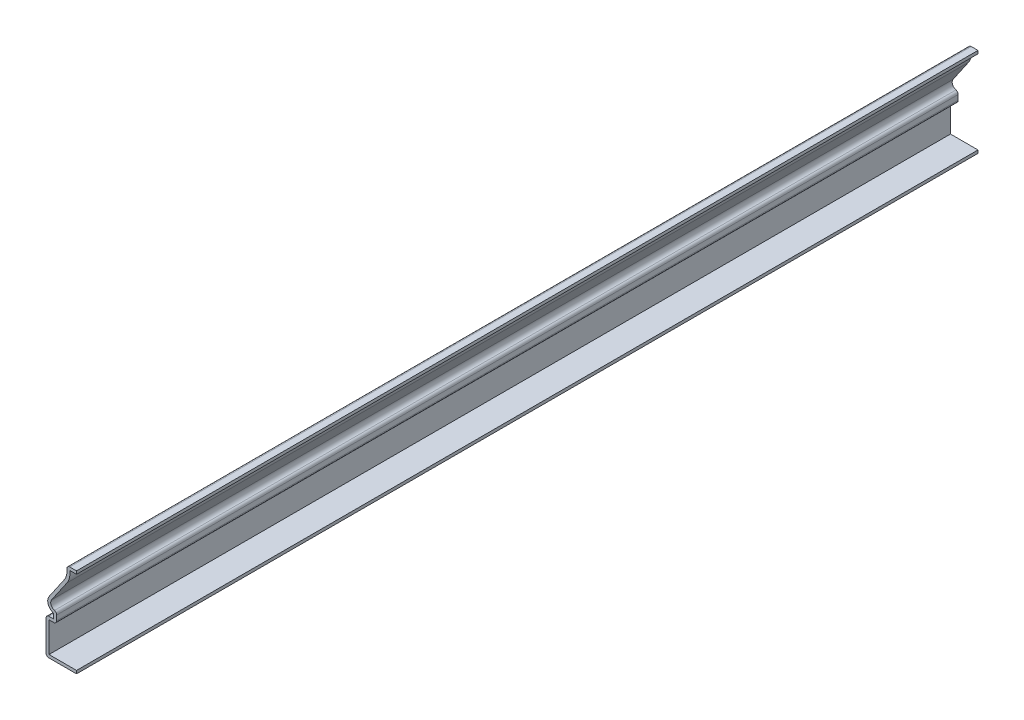
ISO-10303-21;
HEADER;
FILE_DESCRIPTION(('STEP AP214'),'2;1');
FILE_NAME('part.step','',(''),(''),'','','');
FILE_SCHEMA(('AUTOMOTIVE_DESIGN { 1 0 10303 214 1 1 1 1 }'));
ENDSEC;
DATA;
#1=APPLICATION_CONTEXT('core data for automotive mechanical design processes');
#2=APPLICATION_PROTOCOL_DEFINITION('international standard','automotive_design',2000,#1);
#3=PRODUCT_CONTEXT('',#1,'mechanical');
#4=PRODUCT('Part','Part','',(#3));
#5=PRODUCT_RELATED_PRODUCT_CATEGORY('part','',(#4));
#6=PRODUCT_DEFINITION_FORMATION('','',#4);
#7=PRODUCT_DEFINITION_CONTEXT('part definition',#1,'design');
#8=PRODUCT_DEFINITION('design','',#6,#7);
#9=PRODUCT_DEFINITION_SHAPE('','',#8);
#10=(LENGTH_UNIT() NAMED_UNIT(*) SI_UNIT(.MILLI.,.METRE.));
#11=(NAMED_UNIT(*) PLANE_ANGLE_UNIT() SI_UNIT($,.RADIAN.));
#12=(NAMED_UNIT(*) SI_UNIT($,.STERADIAN.) SOLID_ANGLE_UNIT());
#13=UNCERTAINTY_MEASURE_WITH_UNIT(LENGTH_MEASURE(1.E-05),#10,'distance_accuracy_value','');
#14=(GEOMETRIC_REPRESENTATION_CONTEXT(3) GLOBAL_UNCERTAINTY_ASSIGNED_CONTEXT((#13)) GLOBAL_UNIT_ASSIGNED_CONTEXT((#10,
#11,#12)) REPRESENTATION_CONTEXT('',''));
#15=CARTESIAN_POINT('',(0.,0.,0.));
#16=DIRECTION('',(0.,0.,1.));
#17=DIRECTION('',(1.,0.,0.));
#18=AXIS2_PLACEMENT_3D('',#15,#16,#17);
#19=CARTESIAN_POINT('',(0.,0.,-304.8));
#20=DIRECTION('',(0.,-1.,0.));
#21=DIRECTION('',(1.,0.,0.));
#22=AXIS2_PLACEMENT_3D('',#19,#20,#21);
#23=PLANE('',#22);
#24=DIRECTION('',(1.,0.,0.));
#25=VECTOR('',#24,1.);
#26=CARTESIAN_POINT('',(0.,0.,0.));
#27=LINE('',#26,#25);
#28=CARTESIAN_POINT('',(-9.30275,0.,0.));
#29=VERTEX_POINT('',#28);
#30=CARTESIAN_POINT('',(0.,0.,0.));
#31=VERTEX_POINT('',#30);
#32=EDGE_CURVE('E338',#29,#31,#27,.T.);
#33=ORIENTED_EDGE('',*,*,#32,.F.);
#34=DIRECTION('',(0.,0.,1.));
#35=VECTOR('',#34,1.);
#36=CARTESIAN_POINT('',(-9.30275,0.,-304.8));
#37=LINE('',#36,#35);
#38=CARTESIAN_POINT('',(-9.30275,0.,-304.8));
#39=VERTEX_POINT('',#38);
#40=EDGE_CURVE('E198',#29,#39,#37,.F.);
#41=ORIENTED_EDGE('',*,*,#40,.T.);
#42=DIRECTION('',(1.,0.,0.));
#43=VECTOR('',#42,1.);
#44=CARTESIAN_POINT('',(0.,0.,-304.8));
#45=LINE('',#44,#43);
#46=CARTESIAN_POINT('',(0.,0.,-304.8));
#47=VERTEX_POINT('',#46);
#48=EDGE_CURVE('E191',#39,#47,#45,.T.);
#49=ORIENTED_EDGE('',*,*,#48,.T.);
#50=DIRECTION('',(0.,0.,1.));
#51=VECTOR('',#50,1.);
#52=CARTESIAN_POINT('',(0.,0.,-304.8));
#53=LINE('',#52,#51);
#54=EDGE_CURVE('E195',#47,#31,#53,.T.);
#55=ORIENTED_EDGE('',*,*,#54,.T.);
#56=EDGE_LOOP('',(#33,#41,#49,#55));
#57=FACE_BOUND('',#56,.T.);
#58=ADVANCED_FACE('F35',(#57),#23,.T.);
#59=CARTESIAN_POINT('',(-10.31875,0.,-304.8));
#60=DIRECTION('',(-1.,0.,0.));
#61=DIRECTION('',(0.,0.,1.));
#62=AXIS2_PLACEMENT_3D('',#59,#60,#61);
#63=PLANE('',#62);
#64=DIRECTION('',(0.,-1.,0.));
#65=VECTOR('',#64,1.);
#66=CARTESIAN_POINT('',(-10.31875,0.,-304.8));
#67=LINE('',#66,#65);
#68=CARTESIAN_POINT('',(-10.31875,11.1835180216001,-304.8));
#69=VERTEX_POINT('',#68);
#70=CARTESIAN_POINT('',(-10.31875,1.016,-304.8));
#71=VERTEX_POINT('',#70);
#72=EDGE_CURVE('E215',#69,#71,#67,.T.);
#73=ORIENTED_EDGE('',*,*,#72,.T.);
#74=DIRECTION('',(0.,0.,1.));
#75=VECTOR('',#74,1.);
#76=CARTESIAN_POINT('',(-10.31875,1.016,-304.8));
#77=LINE('',#76,#75);
#78=CARTESIAN_POINT('',(-10.31875,1.016,0.));
#79=VERTEX_POINT('',#78);
#80=EDGE_CURVE('E226',#71,#79,#77,.T.);
#81=ORIENTED_EDGE('',*,*,#80,.T.);
#82=DIRECTION('',(0.,-1.,0.));
#83=VECTOR('',#82,1.);
#84=CARTESIAN_POINT('',(-10.31875,0.,0.));
#85=LINE('',#84,#83);
#86=CARTESIAN_POINT('',(-10.31875,11.1835180216001,0.));
#87=VERTEX_POINT('',#86);
#88=EDGE_CURVE('E201',#87,#79,#85,.T.);
#89=ORIENTED_EDGE('',*,*,#88,.F.);
#90=DIRECTION('',(0.,0.,1.));
#91=VECTOR('',#90,1.);
#92=CARTESIAN_POINT('',(-10.31875,11.1835180216001,-304.8));
#93=LINE('',#92,#91);
#94=EDGE_CURVE('E224',#87,#69,#93,.F.);
#95=ORIENTED_EDGE('',*,*,#94,.T.);
#96=EDGE_LOOP('',(#73,#81,#89,#95));
#97=FACE_BOUND('',#96,.T.);
#98=ADVANCED_FACE('F407',(#97),#63,.T.);
#99=CARTESIAN_POINT('',(-10.31875,12.1995180216001,-304.8));
#100=DIRECTION('',(0.,1.,0.));
#101=DIRECTION('',(0.,0.,1.));
#102=AXIS2_PLACEMENT_3D('',#99,#100,#101);
#103=PLANE('',#102);
#104=DIRECTION('',(-1.,0.,0.));
#105=VECTOR('',#104,1.);
#106=CARTESIAN_POINT('',(-10.31875,12.1995180216001,-304.8));
#107=LINE('',#106,#105);
#108=CARTESIAN_POINT('',(-7.7260001409812,12.1995180216001,-304.8));
#109=VERTEX_POINT('',#108);
#110=CARTESIAN_POINT('',(-9.30275,12.1995180216001,-304.8));
#111=VERTEX_POINT('',#110);
#112=EDGE_CURVE('E220',#109,#111,#107,.T.);
#113=ORIENTED_EDGE('',*,*,#112,.T.);
#114=DIRECTION('',(0.,0.,1.));
#115=VECTOR('',#114,1.);
#116=CARTESIAN_POINT('',(-9.30275,12.1995180216001,-304.8));
#117=LINE('',#116,#115);
#118=CARTESIAN_POINT('',(-9.30275,12.1995180216001,0.));
#119=VERTEX_POINT('',#118);
#120=EDGE_CURVE('E250',#111,#119,#117,.T.);
#121=ORIENTED_EDGE('',*,*,#120,.T.);
#122=DIRECTION('',(-1.,0.,0.));
#123=VECTOR('',#122,1.);
#124=CARTESIAN_POINT('',(-10.31875,12.1995180216001,0.));
#125=LINE('',#124,#123);
#126=CARTESIAN_POINT('',(-7.7260001409812,12.1995180216001,0.));
#127=VERTEX_POINT('',#126);
#128=EDGE_CURVE('E296',#127,#119,#125,.T.);
#129=ORIENTED_EDGE('',*,*,#128,.F.);
#130=DIRECTION('',(0.,0.,1.));
#131=VECTOR('',#130,1.);
#132=CARTESIAN_POINT('',(-7.7260001409812,12.1995180216001,-304.8));
#133=LINE('',#132,#131);
#134=EDGE_CURVE('E227',#109,#127,#133,.T.);
#135=ORIENTED_EDGE('',*,*,#134,.F.);
#136=EDGE_LOOP('',(#113,#121,#129,#135));
#137=FACE_BOUND('',#136,.T.);
#138=ADVANCED_FACE('F416',(#137),#103,.T.);
#139=CARTESIAN_POINT('',(-7.7260001409812,12.1995180216001,-304.8));
#140=DIRECTION('',(-1.,0.,0.));
#141=DIRECTION('',(0.,0.,1.));
#142=AXIS2_PLACEMENT_3D('',#139,#140,#141);
#143=PLANE('',#142);
#144=DIRECTION('',(0.,-1.,0.));
#145=VECTOR('',#144,1.);
#146=CARTESIAN_POINT('',(-7.7260001409812,12.1995180216001,0.));
#147=LINE('',#146,#145);
#148=CARTESIAN_POINT('',(-7.7260001409812,13.8788362660862,0.));
#149=VERTEX_POINT('',#148);
#150=EDGE_CURVE('E293',#149,#127,#147,.T.);
#151=ORIENTED_EDGE('',*,*,#150,.F.);
#152=DIRECTION('',(0.,0.,1.));
#153=VECTOR('',#152,1.);
#154=CARTESIAN_POINT('',(-7.7260001409812,13.8788362660862,-304.8));
#155=LINE('',#154,#153);
#156=CARTESIAN_POINT('',(-7.7260001409812,13.8788362660862,-304.8));
#157=VERTEX_POINT('',#156);
#158=EDGE_CURVE('E301',#157,#149,#155,.T.);
#159=ORIENTED_EDGE('',*,*,#158,.F.);
#160=DIRECTION('',(0.,-1.,0.));
#161=VECTOR('',#160,1.);
#162=CARTESIAN_POINT('',(-7.7260001409812,12.1995180216001,-304.8));
#163=LINE('',#162,#161);
#164=EDGE_CURVE('E397',#157,#109,#163,.T.);
#165=ORIENTED_EDGE('',*,*,#164,.T.);
#166=ORIENTED_EDGE('',*,*,#134,.T.);
#167=EDGE_LOOP('',(#151,#159,#165,#166));
#168=FACE_BOUND('',#167,.T.);
#169=ADVANCED_FACE('F420',(#168),#143,.T.);
#170=CARTESIAN_POINT('',(-7.01512187012596,16.5090120952056,-304.8));
#171=DIRECTION('',(0.,0.,1.));
#172=DIRECTION('',(1.,0.,0.));
#173=AXIS2_PLACEMENT_3D('',#170,#171,#172);
#174=CYLINDRICAL_SURFACE('',#173,2.72455001937168);
#175=CARTESIAN_POINT('',(-7.01512187012596,16.5090120952056,0.));
#176=DIRECTION('',(0.,0.,1.));
#177=DIRECTION('',(1.,0.,0.));
#178=AXIS2_PLACEMENT_3D('',#175,#176,#177);
#179=CIRCLE('',#178,2.72455001937168);
#180=CARTESIAN_POINT('',(-9.26085892992711,18.0516844085288,0.));
#181=VERTEX_POINT('',#180);
#182=EDGE_CURVE('E290',#181,#149,#179,.T.);
#183=ORIENTED_EDGE('',*,*,#182,.F.);
#184=DIRECTION('',(0.,0.,1.));
#185=VECTOR('',#184,1.);
#186=CARTESIAN_POINT('',(-9.26085892992711,18.0516844085288,-304.8));
#187=LINE('',#186,#185);
#188=CARTESIAN_POINT('',(-9.26085892992711,18.0516844085288,-304.8));
#189=VERTEX_POINT('',#188);
#190=EDGE_CURVE('E303',#189,#181,#187,.T.);
#191=ORIENTED_EDGE('',*,*,#190,.F.);
#192=CARTESIAN_POINT('',(-7.01512187012596,16.5090120952056,-304.8));
#193=DIRECTION('',(0.,0.,1.));
#194=DIRECTION('',(1.,0.,0.));
#195=AXIS2_PLACEMENT_3D('',#192,#193,#194);
#196=CIRCLE('',#195,2.72455001937168);
#197=EDGE_CURVE('E394',#189,#157,#196,.T.);
#198=ORIENTED_EDGE('',*,*,#197,.T.);
#199=ORIENTED_EDGE('',*,*,#158,.T.);
#200=EDGE_LOOP('',(#183,#191,#198,#199));
#201=FACE_BOUND('',#200,.T.);
#202=ADVANCED_FACE('F425',(#201),#174,.T.);
#203=CARTESIAN_POINT('',(-9.26085892992711,18.0516844085288,-304.8));
#204=DIRECTION('',(-0.824259802108183,0.566211778956054,0.));
#205=DIRECTION('',(-0.566211778956054,-0.824259802108183,0.));
#206=AXIS2_PLACEMENT_3D('',#203,#204,#205);
#207=PLANE('',#206);
#208=DIRECTION('',(-0.566211778956054,-0.824259802108183,0.));
#209=VECTOR('',#208,1.);
#210=CARTESIAN_POINT('',(-9.26085892992711,18.0516844085288,0.));
#211=LINE('',#210,#209);
#212=CARTESIAN_POINT('',(-4.0887587730737,25.5809418528579,0.));
#213=VERTEX_POINT('',#212);
#214=EDGE_CURVE('E282',#213,#181,#211,.T.);
#215=ORIENTED_EDGE('',*,*,#214,.F.);
#216=DIRECTION('',(0.,0.,1.));
#217=VECTOR('',#216,1.);
#218=CARTESIAN_POINT('',(-4.0887587730737,25.5809418528579,-304.8));
#219=LINE('',#218,#217);
#220=CARTESIAN_POINT('',(-4.0887587730737,25.5809418528579,-304.8));
#221=VERTEX_POINT('',#220);
#222=EDGE_CURVE('E305',#221,#213,#219,.T.);
#223=ORIENTED_EDGE('',*,*,#222,.F.);
#224=DIRECTION('',(-0.566211778956054,-0.824259802108183,0.));
#225=VECTOR('',#224,1.);
#226=CARTESIAN_POINT('',(-9.26085892992711,18.0516844085288,-304.8));
#227=LINE('',#226,#225);
#228=EDGE_CURVE('E391',#221,#189,#227,.T.);
#229=ORIENTED_EDGE('',*,*,#228,.T.);
#230=ORIENTED_EDGE('',*,*,#190,.T.);
#231=EDGE_LOOP('',(#215,#223,#229,#230));
#232=FACE_BOUND('',#231,.T.);
#233=ADVANCED_FACE('F428',(#232),#207,.T.);
#234=CARTESIAN_POINT('',(-8.12964756766329,28.3567642660051,-304.8));
#235=DIRECTION('',(0.,0.,1.));
#236=DIRECTION('',(1.,0.,0.));
#237=AXIS2_PLACEMENT_3D('',#234,#235,#236);
#238=CYLINDRICAL_SURFACE('',#237,4.90244554478375);
#239=CARTESIAN_POINT('',(-8.12964756766329,28.3567642660051,0.));
#240=DIRECTION('',(0.,0.,-1.));
#241=DIRECTION('',(-1.,0.,0.));
#242=AXIS2_PLACEMENT_3D('',#239,#240,#241);
#243=CIRCLE('',#242,4.90244554478375);
#244=CARTESIAN_POINT('',(-3.27104270146352,29.0109286747817,0.));
#245=VERTEX_POINT('',#244);
#246=EDGE_CURVE('E280',#245,#213,#243,.T.);
#247=ORIENTED_EDGE('',*,*,#246,.F.);
#248=DIRECTION('',(0.,0.,1.));
#249=VECTOR('',#248,1.);
#250=CARTESIAN_POINT('',(-3.27104270146353,29.0109286747817,-304.8));
#251=LINE('',#250,#249);
#252=CARTESIAN_POINT('',(-3.27104270146352,29.0109286747817,-304.8));
#253=VERTEX_POINT('',#252);
#254=EDGE_CURVE('E11',#245,#253,#251,.F.);
#255=ORIENTED_EDGE('',*,*,#254,.T.);
#256=CARTESIAN_POINT('',(-8.12964756766329,28.3567642660051,-304.8));
#257=DIRECTION('',(0.,0.,-1.));
#258=DIRECTION('',(-1.,0.,0.));
#259=AXIS2_PLACEMENT_3D('',#256,#257,#258);
#260=CIRCLE('',#259,4.90244554478375);
#261=EDGE_CURVE('E389',#253,#221,#260,.T.);
#262=ORIENTED_EDGE('',*,*,#261,.T.);
#263=ORIENTED_EDGE('',*,*,#222,.T.);
#264=EDGE_LOOP('',(#247,#255,#262,#263));
#265=FACE_BOUND('',#264,.T.);
#266=ADVANCED_FACE('F433',(#265),#238,.F.);
#267=CARTESIAN_POINT('',(0.,30.1625,-304.8));
#268=DIRECTION('',(0.,1.,0.));
#269=DIRECTION('',(0.,0.,1.));
#270=AXIS2_PLACEMENT_3D('',#267,#268,#269);
#271=PLANE('',#270);
#272=DIRECTION('',(-1.,0.,0.));
#273=VECTOR('',#272,1.);
#274=CARTESIAN_POINT('',(0.,30.1625,-304.8));
#275=LINE('',#274,#273);
#276=CARTESIAN_POINT('',(0.,30.1625,-304.8));
#277=VERTEX_POINT('',#276);
#278=CARTESIAN_POINT('',(-2.26412839737477,30.1625,-304.8));
#279=VERTEX_POINT('',#278);
#280=EDGE_CURVE('E270',#277,#279,#275,.T.);
#281=ORIENTED_EDGE('',*,*,#280,.T.);
#282=DIRECTION('',(0.,0.,1.));
#283=VECTOR('',#282,1.);
#284=CARTESIAN_POINT('',(-2.26412839737477,30.1625,-304.8));
#285=LINE('',#284,#283);
#286=CARTESIAN_POINT('',(-2.26412839737477,30.1625,0.));
#287=VERTEX_POINT('',#286);
#288=EDGE_CURVE('E43',#279,#287,#285,.T.);
#289=ORIENTED_EDGE('',*,*,#288,.T.);
#290=DIRECTION('',(-1.,0.,0.));
#291=VECTOR('',#290,1.);
#292=CARTESIAN_POINT('',(0.,30.1625,0.));
#293=LINE('',#292,#291);
#294=CARTESIAN_POINT('',(0.,30.1625,0.));
#295=VERTEX_POINT('',#294);
#296=EDGE_CURVE('E268',#295,#287,#293,.T.);
#297=ORIENTED_EDGE('',*,*,#296,.F.);
#298=DIRECTION('',(0.,0.,1.));
#299=VECTOR('',#298,1.);
#300=CARTESIAN_POINT('',(0.,30.1625,-304.8));
#301=LINE('',#300,#299);
#302=EDGE_CURVE('E308',#277,#295,#301,.T.);
#303=ORIENTED_EDGE('',*,*,#302,.F.);
#304=EDGE_LOOP('',(#281,#289,#297,#303));
#305=FACE_BOUND('',#304,.T.);
#306=ADVANCED_FACE('F267',(#305),#271,.T.);
#307=CARTESIAN_POINT('',(0.,30.1625,-304.8));
#308=DIRECTION('',(-1.,0.,0.));
#309=DIRECTION('',(0.,0.,1.));
#310=AXIS2_PLACEMENT_3D('',#307,#308,#309);
#311=PLANE('',#310);
#312=DIRECTION('',(0.,-1.,0.));
#313=VECTOR('',#312,1.);
#314=CARTESIAN_POINT('',(0.,30.1625,0.));
#315=LINE('',#314,#313);
#316=CARTESIAN_POINT('',(0.,29.1465,0.));
#317=VERTEX_POINT('',#316);
#318=EDGE_CURVE('E279',#295,#317,#315,.T.);
#319=ORIENTED_EDGE('',*,*,#318,.T.);
#320=DIRECTION('',(0.,0.,1.));
#321=VECTOR('',#320,1.);
#322=CARTESIAN_POINT('',(0.,29.1465,-304.8));
#323=LINE('',#322,#321);
#324=CARTESIAN_POINT('',(0.,29.1465,-304.8));
#325=VERTEX_POINT('',#324);
#326=EDGE_CURVE('E310',#325,#317,#323,.T.);
#327=ORIENTED_EDGE('',*,*,#326,.F.);
#328=DIRECTION('',(0.,-1.,0.));
#329=VECTOR('',#328,1.);
#330=CARTESIAN_POINT('',(0.,30.1625,-304.8));
#331=LINE('',#330,#329);
#332=EDGE_CURVE('E386',#277,#325,#331,.T.);
#333=ORIENTED_EDGE('',*,*,#332,.F.);
#334=ORIENTED_EDGE('',*,*,#302,.T.);
#335=EDGE_LOOP('',(#319,#327,#333,#334));
#336=FACE_BOUND('',#335,.T.);
#337=ADVANCED_FACE('F440',(#336),#311,.F.);
#338=CARTESIAN_POINT('',(0.,29.1465,-304.8));
#339=DIRECTION('',(0.,1.,0.));
#340=DIRECTION('',(0.,0.,1.));
#341=AXIS2_PLACEMENT_3D('',#338,#339,#340);
#342=PLANE('',#341);
#343=DIRECTION('',(1.,0.,0.));
#344=VECTOR('',#343,1.);
#345=CARTESIAN_POINT('',(0.,29.1465,0.));
#346=LINE('',#345,#344);
#347=CARTESIAN_POINT('',(-2.26412839737477,29.1465,0.));
#348=VERTEX_POINT('',#347);
#349=EDGE_CURVE('E284',#317,#348,#346,.F.);
#350=ORIENTED_EDGE('',*,*,#349,.T.);
#351=DIRECTION('',(0.,0.,1.));
#352=VECTOR('',#351,1.);
#353=CARTESIAN_POINT('',(-2.26412839737477,29.1465,-304.8));
#354=LINE('',#353,#352);
#355=CARTESIAN_POINT('',(-2.26412839737477,29.1465,-304.8));
#356=VERTEX_POINT('',#355);
#357=EDGE_CURVE('E313',#356,#348,#354,.T.);
#358=ORIENTED_EDGE('',*,*,#357,.F.);
#359=DIRECTION('',(1.,0.,0.));
#360=VECTOR('',#359,1.);
#361=CARTESIAN_POINT('',(0.,29.1465,-304.8));
#362=LINE('',#361,#360);
#363=EDGE_CURVE('E384',#325,#356,#362,.F.);
#364=ORIENTED_EDGE('',*,*,#363,.F.);
#365=ORIENTED_EDGE('',*,*,#326,.T.);
#366=EDGE_LOOP('',(#350,#358,#364,#365));
#367=FACE_BOUND('',#366,.T.);
#368=ADVANCED_FACE('F353',(#367),#342,.F.);
#369=CARTESIAN_POINT('',(-8.12964756766329,28.3567642660051,-304.8));
#370=DIRECTION('',(0.,0.,1.));
#371=DIRECTION('',(1.,0.,0.));
#372=AXIS2_PLACEMENT_3D('',#369,#370,#371);
#373=CYLINDRICAL_SURFACE('',#372,5.91844554478375);
#374=CARTESIAN_POINT('',(-8.12964756766329,28.3567642660051,0.));
#375=DIRECTION('',(0.,0.,1.));
#376=DIRECTION('',(1.,0.,0.));
#377=AXIS2_PLACEMENT_3D('',#374,#375,#376);
#378=CIRCLE('',#377,5.91844554478375);
#379=CARTESIAN_POINT('',(-3.25131081413178,25.0056706854386,0.));
#380=VERTEX_POINT('',#379);
#381=EDGE_CURVE('E350',#348,#380,#378,.F.);
#382=ORIENTED_EDGE('',*,*,#381,.T.);
#383=DIRECTION('',(0.,0.,1.));
#384=VECTOR('',#383,1.);
#385=CARTESIAN_POINT('',(-3.25131081413178,25.0056706854386,-304.8));
#386=LINE('',#385,#384);
#387=CARTESIAN_POINT('',(-3.25131081413178,25.0056706854386,-304.8));
#388=VERTEX_POINT('',#387);
#389=EDGE_CURVE('E316',#388,#380,#386,.T.);
#390=ORIENTED_EDGE('',*,*,#389,.F.);
#391=CARTESIAN_POINT('',(-8.12964756766329,28.3567642660051,-304.8));
#392=DIRECTION('',(0.,0.,1.));
#393=DIRECTION('',(1.,0.,0.));
#394=AXIS2_PLACEMENT_3D('',#391,#392,#393);
#395=CIRCLE('',#394,5.91844554478375);
#396=EDGE_CURVE('E361',#356,#388,#395,.F.);
#397=ORIENTED_EDGE('',*,*,#396,.F.);
#398=ORIENTED_EDGE('',*,*,#357,.T.);
#399=EDGE_LOOP('',(#382,#390,#397,#398));
#400=FACE_BOUND('',#399,.T.);
#401=ADVANCED_FACE('F359',(#400),#373,.T.);
#402=CARTESIAN_POINT('',(-8.4234109709852,17.4764132411095,-304.8));
#403=DIRECTION('',(-0.824259802108183,0.566211778956054,0.));
#404=DIRECTION('',(-0.566211778956054,-0.824259802108183,0.));
#405=AXIS2_PLACEMENT_3D('',#402,#403,#404);
#406=PLANE('',#405);
#407=DIRECTION('',(-0.566211778956054,-0.824259802108183,0.));
#408=VECTOR('',#407,1.);
#409=CARTESIAN_POINT('',(-8.4234109709852,17.4764132411095,0.));
#410=LINE('',#409,#408);
#411=CARTESIAN_POINT('',(-8.4234109709852,17.4764132411095,0.));
#412=VERTEX_POINT('',#411);
#413=EDGE_CURVE('E348',#380,#412,#410,.T.);
#414=ORIENTED_EDGE('',*,*,#413,.T.);
#415=DIRECTION('',(0.,0.,1.));
#416=VECTOR('',#415,1.);
#417=CARTESIAN_POINT('',(-8.4234109709852,17.4764132411095,-304.8));
#418=LINE('',#417,#416);
#419=CARTESIAN_POINT('',(-8.4234109709852,17.4764132411095,-304.8));
#420=VERTEX_POINT('',#419);
#421=EDGE_CURVE('E319',#420,#412,#418,.T.);
#422=ORIENTED_EDGE('',*,*,#421,.F.);
#423=DIRECTION('',(-0.566211778956054,-0.824259802108183,0.));
#424=VECTOR('',#423,1.);
#425=CARTESIAN_POINT('',(-8.4234109709852,17.4764132411095,-304.8));
#426=LINE('',#425,#424);
#427=EDGE_CURVE('E375',#388,#420,#426,.T.);
#428=ORIENTED_EDGE('',*,*,#427,.F.);
#429=ORIENTED_EDGE('',*,*,#389,.T.);
#430=EDGE_LOOP('',(#414,#422,#428,#429));
#431=FACE_BOUND('',#430,.T.);
#432=ADVANCED_FACE('F366',(#431),#406,.F.);
#433=CARTESIAN_POINT('',(-7.01512187012596,16.5090120952056,-304.8));
#434=DIRECTION('',(0.,0.,1.));
#435=DIRECTION('',(1.,0.,0.));
#436=AXIS2_PLACEMENT_3D('',#433,#434,#435);
#437=CYLINDRICAL_SURFACE('',#436,1.70855001937168);
#438=CARTESIAN_POINT('',(-7.01512187012596,16.5090120952056,0.));
#439=DIRECTION('',(0.,0.,1.));
#440=DIRECTION('',(1.,0.,0.));
#441=AXIS2_PLACEMENT_3D('',#438,#439,#440);
#442=CIRCLE('',#441,1.70855001937168);
#443=CARTESIAN_POINT('',(-7.46090964234705,14.8596436006499,0.));
#444=VERTEX_POINT('',#443);
#445=EDGE_CURVE('E345',#412,#444,#442,.T.);
#446=ORIENTED_EDGE('',*,*,#445,.T.);
#447=DIRECTION('',(0.,0.,1.));
#448=VECTOR('',#447,1.);
#449=CARTESIAN_POINT('',(-7.46090964234705,14.8596436006499,-304.8));
#450=LINE('',#449,#448);
#451=CARTESIAN_POINT('',(-7.46090964234705,14.8596436006499,-304.8));
#452=VERTEX_POINT('',#451);
#453=EDGE_CURVE('E260',#444,#452,#450,.F.);
#454=ORIENTED_EDGE('',*,*,#453,.T.);
#455=CARTESIAN_POINT('',(-7.01512187012596,16.5090120952056,-304.8));
#456=DIRECTION('',(0.,0.,1.));
#457=DIRECTION('',(1.,0.,0.));
#458=AXIS2_PLACEMENT_3D('',#455,#456,#457);
#459=CIRCLE('',#458,1.70855001937168);
#460=EDGE_CURVE('E373',#420,#452,#459,.T.);
#461=ORIENTED_EDGE('',*,*,#460,.F.);
#462=ORIENTED_EDGE('',*,*,#421,.T.);
#463=EDGE_LOOP('',(#446,#454,#461,#462));
#464=FACE_BOUND('',#463,.T.);
#465=ADVANCED_FACE('F370',(#464),#437,.F.);
#466=CARTESIAN_POINT('',(-6.7100001409812,12.1995180216001,-304.8));
#467=DIRECTION('',(-1.,0.,0.));
#468=DIRECTION('',(0.,0.,1.));
#469=AXIS2_PLACEMENT_3D('',#466,#467,#468);
#470=PLANE('',#469);
#471=DIRECTION('',(0.,1.,0.));
#472=VECTOR('',#471,1.);
#473=CARTESIAN_POINT('',(-6.7100001409812,12.1995180216001,0.));
#474=LINE('',#473,#472);
#475=CARTESIAN_POINT('',(-6.7100001409812,13.8788362660862,0.));
#476=VERTEX_POINT('',#475);
#477=CARTESIAN_POINT('',(-6.7100001409812,12.1995180216001,0.));
#478=VERTEX_POINT('',#477);
#479=EDGE_CURVE('E343',#476,#478,#474,.F.);
#480=ORIENTED_EDGE('',*,*,#479,.T.);
#481=DIRECTION('',(0.,0.,1.));
#482=VECTOR('',#481,1.);
#483=CARTESIAN_POINT('',(-6.7100001409812,12.1995180216001,-304.8));
#484=LINE('',#483,#482);
#485=CARTESIAN_POINT('',(-6.7100001409812,12.1995180216001,-304.8));
#486=VERTEX_POINT('',#485);
#487=EDGE_CURVE('E58',#478,#486,#484,.F.);
#488=ORIENTED_EDGE('',*,*,#487,.T.);
#489=DIRECTION('',(0.,1.,0.));
#490=VECTOR('',#489,1.);
#491=CARTESIAN_POINT('',(-6.7100001409812,12.1995180216001,-304.8));
#492=LINE('',#491,#490);
#493=CARTESIAN_POINT('',(-6.7100001409812,13.8788362660862,-304.8));
#494=VERTEX_POINT('',#493);
#495=EDGE_CURVE('E376',#494,#486,#492,.F.);
#496=ORIENTED_EDGE('',*,*,#495,.F.);
#497=DIRECTION('',(0.,0.,1.));
#498=VECTOR('',#497,1.);
#499=CARTESIAN_POINT('',(-6.7100001409812,13.8788362660862,-304.8));
#500=LINE('',#499,#498);
#501=EDGE_CURVE('E256',#494,#476,#500,.T.);
#502=ORIENTED_EDGE('',*,*,#501,.T.);
#503=EDGE_LOOP('',(#480,#488,#496,#502));
#504=FACE_BOUND('',#503,.T.);
#505=ADVANCED_FACE('F466',(#504),#470,.F.);
#506=CARTESIAN_POINT('',(-10.31875,11.1835180216001,-304.8));
#507=DIRECTION('',(0.,1.,0.));
#508=DIRECTION('',(0.,0.,1.));
#509=AXIS2_PLACEMENT_3D('',#506,#507,#508);
#510=PLANE('',#509);
#511=DIRECTION('',(1.,0.,0.));
#512=VECTOR('',#511,1.);
#513=CARTESIAN_POINT('',(-10.31875,11.1835180216001,-304.8));
#514=LINE('',#513,#512);
#515=CARTESIAN_POINT('',(-7.7260001409812,11.1835180216001,-304.8));
#516=VERTEX_POINT('',#515);
#517=CARTESIAN_POINT('',(-9.30275,11.1835180216001,-304.8));
#518=VERTEX_POINT('',#517);
#519=EDGE_CURVE('E379',#516,#518,#514,.F.);
#520=ORIENTED_EDGE('',*,*,#519,.F.);
#521=DIRECTION('',(0.,0.,1.));
#522=VECTOR('',#521,1.);
#523=CARTESIAN_POINT('',(-7.7260001409812,11.1835180216001,-304.8));
#524=LINE('',#523,#522);
#525=CARTESIAN_POINT('',(-7.7260001409812,11.1835180216001,0.));
#526=VERTEX_POINT('',#525);
#527=EDGE_CURVE('E253',#516,#526,#524,.T.);
#528=ORIENTED_EDGE('',*,*,#527,.T.);
#529=DIRECTION('',(1.,0.,0.));
#530=VECTOR('',#529,1.);
#531=CARTESIAN_POINT('',(-10.31875,11.1835180216001,0.));
#532=LINE('',#531,#530);
#533=CARTESIAN_POINT('',(-9.30275,11.1835180216001,0.));
#534=VERTEX_POINT('',#533);
#535=EDGE_CURVE('E336',#526,#534,#532,.F.);
#536=ORIENTED_EDGE('',*,*,#535,.T.);
#537=DIRECTION('',(0.,0.,1.));
#538=VECTOR('',#537,1.);
#539=CARTESIAN_POINT('',(-9.30275,11.1835180216001,-304.8));
#540=LINE('',#539,#538);
#541=EDGE_CURVE('E322',#518,#534,#540,.T.);
#542=ORIENTED_EDGE('',*,*,#541,.F.);
#543=EDGE_LOOP('',(#520,#528,#536,#542));
#544=FACE_BOUND('',#543,.T.);
#545=ADVANCED_FACE('F470',(#544),#510,.F.);
#546=CARTESIAN_POINT('',(-9.30275,0.,-304.8));
#547=DIRECTION('',(-1.,0.,0.));
#548=DIRECTION('',(0.,0.,1.));
#549=AXIS2_PLACEMENT_3D('',#546,#547,#548);
#550=PLANE('',#549);
#551=DIRECTION('',(0.,1.,0.));
#552=VECTOR('',#551,1.);
#553=CARTESIAN_POINT('',(-9.30275,0.,0.));
#554=LINE('',#553,#552);
#555=CARTESIAN_POINT('',(-9.30275,1.016,0.));
#556=VERTEX_POINT('',#555);
#557=EDGE_CURVE('E334',#534,#556,#554,.F.);
#558=ORIENTED_EDGE('',*,*,#557,.T.);
#559=DIRECTION('',(0.,0.,1.));
#560=VECTOR('',#559,1.);
#561=CARTESIAN_POINT('',(-9.30275,1.016,-304.8));
#562=LINE('',#561,#560);
#563=CARTESIAN_POINT('',(-9.30275,1.016,-304.8));
#564=VERTEX_POINT('',#563);
#565=EDGE_CURVE('E217',#564,#556,#562,.T.);
#566=ORIENTED_EDGE('',*,*,#565,.F.);
#567=DIRECTION('',(0.,1.,0.));
#568=VECTOR('',#567,1.);
#569=CARTESIAN_POINT('',(-9.30275,0.,-304.8));
#570=LINE('',#569,#568);
#571=EDGE_CURVE('E472',#518,#564,#570,.F.);
#572=ORIENTED_EDGE('',*,*,#571,.F.);
#573=ORIENTED_EDGE('',*,*,#541,.T.);
#574=EDGE_LOOP('',(#558,#566,#572,#573));
#575=FACE_BOUND('',#574,.T.);
#576=ADVANCED_FACE('F475',(#575),#550,.F.);
#577=CARTESIAN_POINT('',(0.,1.016,-304.8));
#578=DIRECTION('',(0.,-1.,0.));
#579=DIRECTION('',(1.,0.,0.));
#580=AXIS2_PLACEMENT_3D('',#577,#578,#579);
#581=PLANE('',#580);
#582=DIRECTION('',(1.,0.,0.));
#583=VECTOR('',#582,1.);
#584=CARTESIAN_POINT('',(0.,1.016,0.));
#585=LINE('',#584,#583);
#586=CARTESIAN_POINT('',(0.,1.016,0.));
#587=VERTEX_POINT('',#586);
#588=EDGE_CURVE('E329',#556,#587,#585,.T.);
#589=ORIENTED_EDGE('',*,*,#588,.T.);
#590=DIRECTION('',(0.,0.,1.));
#591=VECTOR('',#590,1.);
#592=CARTESIAN_POINT('',(0.,1.016,-304.8));
#593=LINE('',#592,#591);
#594=CARTESIAN_POINT('',(0.,1.016,-304.8));
#595=VERTEX_POINT('',#594);
#596=EDGE_CURVE('E214',#595,#587,#593,.T.);
#597=ORIENTED_EDGE('',*,*,#596,.F.);
#598=DIRECTION('',(1.,0.,0.));
#599=VECTOR('',#598,1.);
#600=CARTESIAN_POINT('',(0.,1.016,-304.8));
#601=LINE('',#600,#599);
#602=EDGE_CURVE('E206',#564,#595,#601,.T.);
#603=ORIENTED_EDGE('',*,*,#602,.F.);
#604=ORIENTED_EDGE('',*,*,#565,.T.);
#605=EDGE_LOOP('',(#589,#597,#603,#604));
#606=FACE_BOUND('',#605,.T.);
#607=ADVANCED_FACE('F328',(#606),#581,.F.);
#608=CARTESIAN_POINT('',(0.,1.016,-304.8));
#609=DIRECTION('',(-1.,0.,0.));
#610=DIRECTION('',(0.,-1.,0.));
#611=AXIS2_PLACEMENT_3D('',#608,#609,#610);
#612=PLANE('',#611);
#613=DIRECTION('',(0.,-1.,0.));
#614=VECTOR('',#613,1.);
#615=CARTESIAN_POINT('',(0.,1.016,0.));
#616=LINE('',#615,#614);
#617=EDGE_CURVE('E213',#587,#31,#616,.T.);
#618=ORIENTED_EDGE('',*,*,#617,.T.);
#619=ORIENTED_EDGE('',*,*,#54,.F.);
#620=DIRECTION('',(0.,-1.,0.));
#621=VECTOR('',#620,1.);
#622=CARTESIAN_POINT('',(0.,1.016,-304.8));
#623=LINE('',#622,#621);
#624=EDGE_CURVE('E200',#595,#47,#623,.T.);
#625=ORIENTED_EDGE('',*,*,#624,.F.);
#626=ORIENTED_EDGE('',*,*,#596,.T.);
#627=EDGE_LOOP('',(#618,#619,#625,#626));
#628=FACE_BOUND('',#627,.T.);
#629=ADVANCED_FACE('F211',(#628),#612,.F.);
#630=CARTESIAN_POINT('',(-7.01512187012596,16.5090120952056,-304.8));
#631=DIRECTION('',(0.,0.,1.));
#632=DIRECTION('',(1.,0.,0.));
#633=AXIS2_PLACEMENT_3D('',#630,#631,#632);
#634=PLANE('',#633);
#635=ORIENTED_EDGE('',*,*,#48,.F.);
#636=CARTESIAN_POINT('',(-9.30275,1.016,-304.8));
#637=DIRECTION('',(0.,0.,1.));
#638=DIRECTION('',(1.,0.,0.));
#639=AXIS2_PLACEMENT_3D('',#636,#637,#638);
#640=CIRCLE('',#639,1.016);
#641=EDGE_CURVE('E248',#39,#71,#640,.F.);
#642=ORIENTED_EDGE('',*,*,#641,.T.);
#643=ORIENTED_EDGE('',*,*,#72,.F.);
#644=CARTESIAN_POINT('',(-9.30275,11.1835180216001,-304.8));
#645=DIRECTION('',(0.,0.,1.));
#646=DIRECTION('',(1.,0.,0.));
#647=AXIS2_PLACEMENT_3D('',#644,#645,#646);
#648=CIRCLE('',#647,1.016);
#649=EDGE_CURVE('E246',#69,#111,#648,.F.);
#650=ORIENTED_EDGE('',*,*,#649,.T.);
#651=ORIENTED_EDGE('',*,*,#112,.F.);
#652=ORIENTED_EDGE('',*,*,#164,.F.);
#653=ORIENTED_EDGE('',*,*,#197,.F.);
#654=ORIENTED_EDGE('',*,*,#228,.F.);
#655=ORIENTED_EDGE('',*,*,#261,.F.);
#656=CARTESIAN_POINT('',(-2.26412839737477,29.1465,-304.8));
#657=DIRECTION('',(0.,0.,1.));
#658=DIRECTION('',(1.,0.,0.));
#659=AXIS2_PLACEMENT_3D('',#656,#657,#658);
#660=CIRCLE('',#659,1.016);
#661=EDGE_CURVE('E241',#253,#279,#660,.F.);
#662=ORIENTED_EDGE('',*,*,#661,.T.);
#663=ORIENTED_EDGE('',*,*,#280,.F.);
#664=ORIENTED_EDGE('',*,*,#332,.T.);
#665=ORIENTED_EDGE('',*,*,#363,.T.);
#666=ORIENTED_EDGE('',*,*,#396,.T.);
#667=ORIENTED_EDGE('',*,*,#427,.T.);
#668=ORIENTED_EDGE('',*,*,#460,.T.);
#669=CARTESIAN_POINT('',(-7.7260001409812,13.8788362660862,-304.8));
#670=DIRECTION('',(0.,0.,1.));
#671=DIRECTION('',(1.,0.,0.));
#672=AXIS2_PLACEMENT_3D('',#669,#670,#671);
#673=CIRCLE('',#672,1.016);
#674=EDGE_CURVE('E243',#452,#494,#673,.F.);
#675=ORIENTED_EDGE('',*,*,#674,.T.);
#676=ORIENTED_EDGE('',*,*,#495,.T.);
#677=CARTESIAN_POINT('',(-7.7260001409812,12.1995180216001,-304.8));
#678=DIRECTION('',(0.,0.,1.));
#679=DIRECTION('',(1.,0.,0.));
#680=AXIS2_PLACEMENT_3D('',#677,#678,#679);
#681=CIRCLE('',#680,1.016);
#682=EDGE_CURVE('E50',#486,#516,#681,.F.);
#683=ORIENTED_EDGE('',*,*,#682,.T.);
#684=ORIENTED_EDGE('',*,*,#519,.T.);
#685=ORIENTED_EDGE('',*,*,#571,.T.);
#686=ORIENTED_EDGE('',*,*,#602,.T.);
#687=ORIENTED_EDGE('',*,*,#624,.T.);
#688=EDGE_LOOP('',(#635,#642,#643,#650,#651,#652,#653,#654,#655,#662,#663,#664,#665,#666,#667,
#668,#675,#676,#683,#684,#685,#686,#687));
#689=FACE_BOUND('',#688,.T.);
#690=ADVANCED_FACE('F204',(#689),#634,.F.);
#691=CARTESIAN_POINT('',(-7.01512187012596,16.5090120952056,0.));
#692=DIRECTION('',(0.,0.,1.));
#693=DIRECTION('',(1.,0.,0.));
#694=AXIS2_PLACEMENT_3D('',#691,#692,#693);
#695=PLANE('',#694);
#696=ORIENTED_EDGE('',*,*,#88,.T.);
#697=CARTESIAN_POINT('',(-9.30275,1.016,0.));
#698=DIRECTION('',(0.,0.,1.));
#699=DIRECTION('',(1.,0.,0.));
#700=AXIS2_PLACEMENT_3D('',#697,#698,#699);
#701=CIRCLE('',#700,1.016);
#702=EDGE_CURVE('E238',#79,#29,#701,.T.);
#703=ORIENTED_EDGE('',*,*,#702,.T.);
#704=ORIENTED_EDGE('',*,*,#32,.T.);
#705=ORIENTED_EDGE('',*,*,#617,.F.);
#706=ORIENTED_EDGE('',*,*,#588,.F.);
#707=ORIENTED_EDGE('',*,*,#557,.F.);
#708=ORIENTED_EDGE('',*,*,#535,.F.);
#709=CARTESIAN_POINT('',(-7.7260001409812,12.1995180216001,0.));
#710=DIRECTION('',(0.,0.,1.));
#711=DIRECTION('',(1.,0.,0.));
#712=AXIS2_PLACEMENT_3D('',#709,#710,#711);
#713=CIRCLE('',#712,1.016);
#714=EDGE_CURVE('E234',#526,#478,#713,.T.);
#715=ORIENTED_EDGE('',*,*,#714,.T.);
#716=ORIENTED_EDGE('',*,*,#479,.F.);
#717=CARTESIAN_POINT('',(-7.7260001409812,13.8788362660862,0.));
#718=DIRECTION('',(0.,0.,1.));
#719=DIRECTION('',(1.,0.,0.));
#720=AXIS2_PLACEMENT_3D('',#717,#718,#719);
#721=CIRCLE('',#720,1.016);
#722=EDGE_CURVE('E232',#476,#444,#721,.T.);
#723=ORIENTED_EDGE('',*,*,#722,.T.);
#724=ORIENTED_EDGE('',*,*,#445,.F.);
#725=ORIENTED_EDGE('',*,*,#413,.F.);
#726=ORIENTED_EDGE('',*,*,#381,.F.);
#727=ORIENTED_EDGE('',*,*,#349,.F.);
#728=ORIENTED_EDGE('',*,*,#318,.F.);
#729=ORIENTED_EDGE('',*,*,#296,.T.);
#730=CARTESIAN_POINT('',(-2.26412839737477,29.1465,0.));
#731=DIRECTION('',(0.,0.,1.));
#732=DIRECTION('',(1.,0.,0.));
#733=AXIS2_PLACEMENT_3D('',#730,#731,#732);
#734=CIRCLE('',#733,1.016);
#735=EDGE_CURVE('E230',#287,#245,#734,.T.);
#736=ORIENTED_EDGE('',*,*,#735,.T.);
#737=ORIENTED_EDGE('',*,*,#246,.T.);
#738=ORIENTED_EDGE('',*,*,#214,.T.);
#739=ORIENTED_EDGE('',*,*,#182,.T.);
#740=ORIENTED_EDGE('',*,*,#150,.T.);
#741=ORIENTED_EDGE('',*,*,#128,.T.);
#742=CARTESIAN_POINT('',(-9.30275,11.1835180216001,0.));
#743=DIRECTION('',(0.,0.,1.));
#744=DIRECTION('',(1.,0.,0.));
#745=AXIS2_PLACEMENT_3D('',#742,#743,#744);
#746=CIRCLE('',#745,1.016);
#747=EDGE_CURVE('E236',#119,#87,#746,.T.);
#748=ORIENTED_EDGE('',*,*,#747,.T.);
#749=EDGE_LOOP('',(#696,#703,#704,#705,#706,#707,#708,#715,#716,#723,#724,#725,#726,#727,#728,
#729,#736,#737,#738,#739,#740,#741,#748));
#750=FACE_BOUND('',#749,.T.);
#751=ADVANCED_FACE('F276',(#750),#695,.T.);
#752=CARTESIAN_POINT('',(-9.30275,1.016,-304.8));
#753=DIRECTION('',(0.,0.,1.));
#754=DIRECTION('',(1.,0.,0.));
#755=AXIS2_PLACEMENT_3D('',#752,#753,#754);
#756=CYLINDRICAL_SURFACE('',#755,1.016);
#757=ORIENTED_EDGE('',*,*,#641,.F.);
#758=ORIENTED_EDGE('',*,*,#40,.F.);
#759=ORIENTED_EDGE('',*,*,#702,.F.);
#760=ORIENTED_EDGE('',*,*,#80,.F.);
#761=EDGE_LOOP('',(#757,#758,#759,#760));
#762=FACE_BOUND('',#761,.T.);
#763=ADVANCED_FACE('F402',(#762),#756,.T.);
#764=CARTESIAN_POINT('',(-9.30275,11.1835180216001,-304.8));
#765=DIRECTION('',(0.,0.,1.));
#766=DIRECTION('',(1.,0.,0.));
#767=AXIS2_PLACEMENT_3D('',#764,#765,#766);
#768=CYLINDRICAL_SURFACE('',#767,1.016);
#769=ORIENTED_EDGE('',*,*,#649,.F.);
#770=ORIENTED_EDGE('',*,*,#94,.F.);
#771=ORIENTED_EDGE('',*,*,#747,.F.);
#772=ORIENTED_EDGE('',*,*,#120,.F.);
#773=EDGE_LOOP('',(#769,#770,#771,#772));
#774=FACE_BOUND('',#773,.T.);
#775=ADVANCED_FACE('F411',(#774),#768,.T.);
#776=CARTESIAN_POINT('',(-7.7260001409812,12.1995180216001,-304.8));
#777=DIRECTION('',(0.,0.,1.));
#778=DIRECTION('',(1.,0.,0.));
#779=AXIS2_PLACEMENT_3D('',#776,#777,#778);
#780=CYLINDRICAL_SURFACE('',#779,1.016);
#781=ORIENTED_EDGE('',*,*,#682,.F.);
#782=ORIENTED_EDGE('',*,*,#487,.F.);
#783=ORIENTED_EDGE('',*,*,#714,.F.);
#784=ORIENTED_EDGE('',*,*,#527,.F.);
#785=EDGE_LOOP('',(#781,#782,#783,#784));
#786=FACE_BOUND('',#785,.T.);
#787=ADVANCED_FACE('F456',(#786),#780,.T.);
#788=CARTESIAN_POINT('',(-7.7260001409812,13.8788362660862,-304.8));
#789=DIRECTION('',(0.,0.,1.));
#790=DIRECTION('',(1.,0.,0.));
#791=AXIS2_PLACEMENT_3D('',#788,#789,#790);
#792=CYLINDRICAL_SURFACE('',#791,1.016);
#793=ORIENTED_EDGE('',*,*,#674,.F.);
#794=ORIENTED_EDGE('',*,*,#453,.F.);
#795=ORIENTED_EDGE('',*,*,#722,.F.);
#796=ORIENTED_EDGE('',*,*,#501,.F.);
#797=EDGE_LOOP('',(#793,#794,#795,#796));
#798=FACE_BOUND('',#797,.T.);
#799=ADVANCED_FACE('F458',(#798),#792,.T.);
#800=CARTESIAN_POINT('',(-2.26412839737477,29.1465,-304.8));
#801=DIRECTION('',(0.,0.,1.));
#802=DIRECTION('',(1.,0.,0.));
#803=AXIS2_PLACEMENT_3D('',#800,#801,#802);
#804=CYLINDRICAL_SURFACE('',#803,1.016);
#805=ORIENTED_EDGE('',*,*,#661,.F.);
#806=ORIENTED_EDGE('',*,*,#254,.F.);
#807=ORIENTED_EDGE('',*,*,#735,.F.);
#808=ORIENTED_EDGE('',*,*,#288,.F.);
#809=EDGE_LOOP('',(#805,#806,#807,#808));
#810=FACE_BOUND('',#809,.T.);
#811=ADVANCED_FACE('F37',(#810),#804,.T.);
#812=CLOSED_SHELL('',(#58,#98,#138,#169,#202,#233,#266,#306,#337,#368,#401,#432,#465,#505,#545,
#576,#607,#629,#690,#751,#763,#775,#787,#799,#811));
#813=MANIFOLD_SOLID_BREP('B2',#812);
#814=ADVANCED_BREP_SHAPE_REPRESENTATION('',(#18,#813),#14);
#815=SHAPE_DEFINITION_REPRESENTATION(#9,#814);
ENDSEC;
END-ISO-10303-21;
